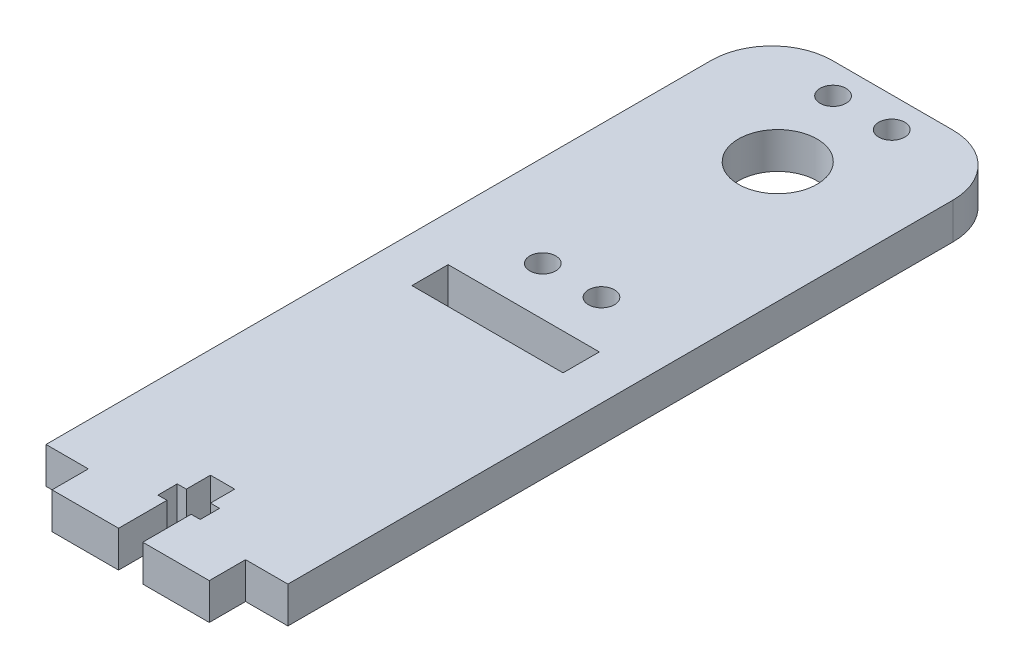
ISO-10303-21;
HEADER;
FILE_DESCRIPTION(('STEP AP214'),'2;1');
FILE_NAME('part.step','',(''),(''),'','','');
FILE_SCHEMA(('AUTOMOTIVE_DESIGN { 1 0 10303 214 1 1 1 1 }'));
ENDSEC;
DATA;
#1=APPLICATION_CONTEXT('core data for automotive mechanical design processes');
#2=APPLICATION_PROTOCOL_DEFINITION('international standard','automotive_design',2000,#1);
#3=PRODUCT_CONTEXT('',#1,'mechanical');
#4=PRODUCT('Part','Part','',(#3));
#5=PRODUCT_RELATED_PRODUCT_CATEGORY('part','',(#4));
#6=PRODUCT_DEFINITION_FORMATION('','',#4);
#7=PRODUCT_DEFINITION_CONTEXT('part definition',#1,'design');
#8=PRODUCT_DEFINITION('design','',#6,#7);
#9=PRODUCT_DEFINITION_SHAPE('','',#8);
#10=(LENGTH_UNIT() NAMED_UNIT(*) SI_UNIT(.MILLI.,.METRE.));
#11=(NAMED_UNIT(*) PLANE_ANGLE_UNIT() SI_UNIT($,.RADIAN.));
#12=(NAMED_UNIT(*) SI_UNIT($,.STERADIAN.) SOLID_ANGLE_UNIT());
#13=UNCERTAINTY_MEASURE_WITH_UNIT(LENGTH_MEASURE(1.E-05),#10,'distance_accuracy_value','');
#14=(GEOMETRIC_REPRESENTATION_CONTEXT(3) GLOBAL_UNCERTAINTY_ASSIGNED_CONTEXT((#13)) GLOBAL_UNIT_ASSIGNED_CONTEXT((#10,
#11,#12)) REPRESENTATION_CONTEXT('',''));
#15=CARTESIAN_POINT('',(0.,0.,0.));
#16=DIRECTION('',(0.,0.,1.));
#17=DIRECTION('',(1.,0.,0.));
#18=AXIS2_PLACEMENT_3D('',#15,#16,#17);
#19=CARTESIAN_POINT('',(13.,-6.,60.));
#20=DIRECTION('',(0.,0.,1.));
#21=DIRECTION('',(1.,0.,0.));
#22=AXIS2_PLACEMENT_3D('',#19,#20,#21);
#23=PLANE('',#22);
#24=DIRECTION('',(1.,0.,0.));
#25=VECTOR('',#24,1.);
#26=CARTESIAN_POINT('',(13.,0.,60.));
#27=LINE('',#26,#25);
#28=CARTESIAN_POINT('',(13.,0.,60.));
#29=VERTEX_POINT('',#28);
#30=CARTESIAN_POINT('',(20.,0.,60.));
#31=VERTEX_POINT('',#30);
#32=EDGE_CURVE('E302',#29,#31,#27,.T.);
#33=ORIENTED_EDGE('',*,*,#32,.F.);
#34=DIRECTION('',(0.,1.,0.));
#35=VECTOR('',#34,1.);
#36=CARTESIAN_POINT('',(13.,-6.,60.));
#37=LINE('',#36,#35);
#38=CARTESIAN_POINT('',(13.,-6.,60.));
#39=VERTEX_POINT('',#38);
#40=EDGE_CURVE('E11',#39,#29,#37,.T.);
#41=ORIENTED_EDGE('',*,*,#40,.F.);
#42=DIRECTION('',(1.,0.,0.));
#43=VECTOR('',#42,1.);
#44=CARTESIAN_POINT('',(13.,-6.,60.));
#45=LINE('',#44,#43);
#46=CARTESIAN_POINT('',(20.,-6.,60.));
#47=VERTEX_POINT('',#46);
#48=EDGE_CURVE('E306',#39,#47,#45,.T.);
#49=ORIENTED_EDGE('',*,*,#48,.T.);
#50=DIRECTION('',(0.,1.,0.));
#51=VECTOR('',#50,1.);
#52=CARTESIAN_POINT('',(20.,-6.,60.));
#53=LINE('',#52,#51);
#54=EDGE_CURVE('E46',#47,#31,#53,.T.);
#55=ORIENTED_EDGE('',*,*,#54,.T.);
#56=EDGE_LOOP('',(#33,#41,#49,#55));
#57=FACE_BOUND('',#56,.T.);
#58=ADVANCED_FACE('F43',(#57),#23,.T.);
#59=CARTESIAN_POINT('',(13.,-6.,66.));
#60=DIRECTION('',(1.,0.,0.));
#61=DIRECTION('',(0.,0.,-1.));
#62=AXIS2_PLACEMENT_3D('',#59,#60,#61);
#63=PLANE('',#62);
#64=DIRECTION('',(0.,0.,-1.));
#65=VECTOR('',#64,1.);
#66=CARTESIAN_POINT('',(13.,0.,66.));
#67=LINE('',#66,#65);
#68=CARTESIAN_POINT('',(13.,0.,66.));
#69=VERTEX_POINT('',#68);
#70=EDGE_CURVE('E311',#69,#29,#67,.T.);
#71=ORIENTED_EDGE('',*,*,#70,.F.);
#72=DIRECTION('',(0.,1.,0.));
#73=VECTOR('',#72,1.);
#74=CARTESIAN_POINT('',(13.,-6.,66.));
#75=LINE('',#74,#73);
#76=CARTESIAN_POINT('',(13.,-6.,66.));
#77=VERTEX_POINT('',#76);
#78=EDGE_CURVE('E52',#77,#69,#75,.T.);
#79=ORIENTED_EDGE('',*,*,#78,.F.);
#80=DIRECTION('',(0.,0.,-1.));
#81=VECTOR('',#80,1.);
#82=CARTESIAN_POINT('',(13.,-6.,66.));
#83=LINE('',#82,#81);
#84=EDGE_CURVE('E391',#77,#39,#83,.T.);
#85=ORIENTED_EDGE('',*,*,#84,.T.);
#86=ORIENTED_EDGE('',*,*,#40,.T.);
#87=EDGE_LOOP('',(#71,#79,#85,#86));
#88=FACE_BOUND('',#87,.T.);
#89=ADVANCED_FACE('F552',(#88),#63,.T.);
#90=CARTESIAN_POINT('',(2.00000000000003,-6.,66.));
#91=DIRECTION('',(0.,0.,1.));
#92=DIRECTION('',(1.,0.,0.));
#93=AXIS2_PLACEMENT_3D('',#90,#91,#92);
#94=PLANE('',#93);
#95=DIRECTION('',(1.,0.,0.));
#96=VECTOR('',#95,1.);
#97=CARTESIAN_POINT('',(2.00000000000003,0.,66.));
#98=LINE('',#97,#96);
#99=CARTESIAN_POINT('',(2.00000000000003,0.,66.));
#100=VERTEX_POINT('',#99);
#101=EDGE_CURVE('E474',#100,#69,#98,.T.);
#102=ORIENTED_EDGE('',*,*,#101,.F.);
#103=DIRECTION('',(0.,1.,0.));
#104=VECTOR('',#103,1.);
#105=CARTESIAN_POINT('',(2.00000000000003,-6.,66.));
#106=LINE('',#105,#104);
#107=CARTESIAN_POINT('',(2.00000000000003,-6.,66.));
#108=VERTEX_POINT('',#107);
#109=EDGE_CURVE('E483',#108,#100,#106,.T.);
#110=ORIENTED_EDGE('',*,*,#109,.F.);
#111=DIRECTION('',(1.,0.,0.));
#112=VECTOR('',#111,1.);
#113=CARTESIAN_POINT('',(2.00000000000003,-6.,66.));
#114=LINE('',#113,#112);
#115=EDGE_CURVE('E387',#108,#77,#114,.T.);
#116=ORIENTED_EDGE('',*,*,#115,.T.);
#117=ORIENTED_EDGE('',*,*,#78,.T.);
#118=EDGE_LOOP('',(#102,#110,#116,#117));
#119=FACE_BOUND('',#118,.T.);
#120=ADVANCED_FACE('F628',(#119),#94,.T.);
#121=CARTESIAN_POINT('',(2.00000000000003,-6.,58.));
#122=DIRECTION('',(-1.,0.,0.));
#123=DIRECTION('',(0.,0.,1.));
#124=AXIS2_PLACEMENT_3D('',#121,#122,#123);
#125=PLANE('',#124);
#126=DIRECTION('',(0.,0.,1.));
#127=VECTOR('',#126,1.);
#128=CARTESIAN_POINT('',(2.00000000000003,0.,58.));
#129=LINE('',#128,#127);
#130=CARTESIAN_POINT('',(2.00000000000003,0.,58.));
#131=VERTEX_POINT('',#130);
#132=EDGE_CURVE('E470',#131,#100,#129,.T.);
#133=ORIENTED_EDGE('',*,*,#132,.F.);
#134=DIRECTION('',(0.,1.,0.));
#135=VECTOR('',#134,1.);
#136=CARTESIAN_POINT('',(2.00000000000003,-6.,58.));
#137=LINE('',#136,#135);
#138=CARTESIAN_POINT('',(2.00000000000003,-6.,58.));
#139=VERTEX_POINT('',#138);
#140=EDGE_CURVE('E486',#139,#131,#137,.T.);
#141=ORIENTED_EDGE('',*,*,#140,.F.);
#142=DIRECTION('',(0.,0.,1.));
#143=VECTOR('',#142,1.);
#144=CARTESIAN_POINT('',(2.00000000000003,-6.,58.));
#145=LINE('',#144,#143);
#146=EDGE_CURVE('E383',#139,#108,#145,.T.);
#147=ORIENTED_EDGE('',*,*,#146,.T.);
#148=ORIENTED_EDGE('',*,*,#109,.T.);
#149=EDGE_LOOP('',(#133,#141,#147,#148));
#150=FACE_BOUND('',#149,.T.);
#151=ADVANCED_FACE('F626',(#150),#125,.T.);
#152=CARTESIAN_POINT('',(3.50000000000003,-6.,58.));
#153=DIRECTION('',(0.,0.,-1.));
#154=DIRECTION('',(-1.,0.,0.));
#155=AXIS2_PLACEMENT_3D('',#152,#153,#154);
#156=PLANE('',#155);
#157=DIRECTION('',(-1.,0.,0.));
#158=VECTOR('',#157,1.);
#159=CARTESIAN_POINT('',(3.50000000000003,0.,58.));
#160=LINE('',#159,#158);
#161=CARTESIAN_POINT('',(3.50000000000003,0.,58.));
#162=VERTEX_POINT('',#161);
#163=EDGE_CURVE('E466',#162,#131,#160,.T.);
#164=ORIENTED_EDGE('',*,*,#163,.F.);
#165=DIRECTION('',(0.,1.,0.));
#166=VECTOR('',#165,1.);
#167=CARTESIAN_POINT('',(3.50000000000003,-6.,58.));
#168=LINE('',#167,#166);
#169=CARTESIAN_POINT('',(3.50000000000003,-6.,58.));
#170=VERTEX_POINT('',#169);
#171=EDGE_CURVE('E489',#170,#162,#168,.T.);
#172=ORIENTED_EDGE('',*,*,#171,.F.);
#173=DIRECTION('',(-1.,0.,0.));
#174=VECTOR('',#173,1.);
#175=CARTESIAN_POINT('',(3.50000000000003,-6.,58.));
#176=LINE('',#175,#174);
#177=EDGE_CURVE('E379',#170,#139,#176,.T.);
#178=ORIENTED_EDGE('',*,*,#177,.T.);
#179=ORIENTED_EDGE('',*,*,#140,.T.);
#180=EDGE_LOOP('',(#164,#172,#178,#179));
#181=FACE_BOUND('',#180,.T.);
#182=ADVANCED_FACE('F622',(#181),#156,.T.);
#183=CARTESIAN_POINT('',(3.50000000000003,-6.,54.8));
#184=DIRECTION('',(-1.,0.,0.));
#185=DIRECTION('',(0.,0.,1.));
#186=AXIS2_PLACEMENT_3D('',#183,#184,#185);
#187=PLANE('',#186);
#188=DIRECTION('',(0.,0.,1.));
#189=VECTOR('',#188,1.);
#190=CARTESIAN_POINT('',(3.50000000000003,0.,54.8));
#191=LINE('',#190,#189);
#192=CARTESIAN_POINT('',(3.50000000000003,0.,54.8));
#193=VERTEX_POINT('',#192);
#194=EDGE_CURVE('E462',#193,#162,#191,.T.);
#195=ORIENTED_EDGE('',*,*,#194,.F.);
#196=DIRECTION('',(0.,1.,0.));
#197=VECTOR('',#196,1.);
#198=CARTESIAN_POINT('',(3.50000000000003,-6.,54.8));
#199=LINE('',#198,#197);
#200=CARTESIAN_POINT('',(3.50000000000003,-6.,54.8));
#201=VERTEX_POINT('',#200);
#202=EDGE_CURVE('E492',#201,#193,#199,.T.);
#203=ORIENTED_EDGE('',*,*,#202,.F.);
#204=DIRECTION('',(0.,0.,1.));
#205=VECTOR('',#204,1.);
#206=CARTESIAN_POINT('',(3.50000000000003,-6.,54.8));
#207=LINE('',#206,#205);
#208=EDGE_CURVE('E375',#201,#170,#207,.T.);
#209=ORIENTED_EDGE('',*,*,#208,.T.);
#210=ORIENTED_EDGE('',*,*,#171,.T.);
#211=EDGE_LOOP('',(#195,#203,#209,#210));
#212=FACE_BOUND('',#211,.T.);
#213=ADVANCED_FACE('F618',(#212),#187,.T.);
#214=CARTESIAN_POINT('',(2.00000000000003,-6.,54.8));
#215=DIRECTION('',(0.,0.,1.));
#216=DIRECTION('',(1.,0.,0.));
#217=AXIS2_PLACEMENT_3D('',#214,#215,#216);
#218=PLANE('',#217);
#219=DIRECTION('',(1.,0.,0.));
#220=VECTOR('',#219,1.);
#221=CARTESIAN_POINT('',(2.00000000000003,0.,54.8));
#222=LINE('',#221,#220);
#223=CARTESIAN_POINT('',(2.00000000000003,0.,54.8));
#224=VERTEX_POINT('',#223);
#225=EDGE_CURVE('E458',#224,#193,#222,.T.);
#226=ORIENTED_EDGE('',*,*,#225,.F.);
#227=DIRECTION('',(0.,1.,0.));
#228=VECTOR('',#227,1.);
#229=CARTESIAN_POINT('',(2.00000000000003,-6.,54.8));
#230=LINE('',#229,#228);
#231=CARTESIAN_POINT('',(2.00000000000003,-6.,54.8));
#232=VERTEX_POINT('',#231);
#233=EDGE_CURVE('E495',#232,#224,#230,.T.);
#234=ORIENTED_EDGE('',*,*,#233,.F.);
#235=DIRECTION('',(1.,0.,0.));
#236=VECTOR('',#235,1.);
#237=CARTESIAN_POINT('',(2.00000000000003,-6.,54.8));
#238=LINE('',#237,#236);
#239=EDGE_CURVE('E371',#232,#201,#238,.T.);
#240=ORIENTED_EDGE('',*,*,#239,.T.);
#241=ORIENTED_EDGE('',*,*,#202,.T.);
#242=EDGE_LOOP('',(#226,#234,#240,#241));
#243=FACE_BOUND('',#242,.T.);
#244=ADVANCED_FACE('F614',(#243),#218,.T.);
#245=CARTESIAN_POINT('',(2.00000000000003,-6.,50.8));
#246=DIRECTION('',(-1.,0.,0.));
#247=DIRECTION('',(0.,0.,1.));
#248=AXIS2_PLACEMENT_3D('',#245,#246,#247);
#249=PLANE('',#248);
#250=DIRECTION('',(0.,0.,1.));
#251=VECTOR('',#250,1.);
#252=CARTESIAN_POINT('',(2.00000000000003,0.,50.8));
#253=LINE('',#252,#251);
#254=CARTESIAN_POINT('',(2.00000000000003,0.,50.8));
#255=VERTEX_POINT('',#254);
#256=EDGE_CURVE('E454',#255,#224,#253,.T.);
#257=ORIENTED_EDGE('',*,*,#256,.F.);
#258=DIRECTION('',(0.,1.,0.));
#259=VECTOR('',#258,1.);
#260=CARTESIAN_POINT('',(2.00000000000003,-6.,50.8));
#261=LINE('',#260,#259);
#262=CARTESIAN_POINT('',(2.00000000000003,-6.,50.8));
#263=VERTEX_POINT('',#262);
#264=EDGE_CURVE('E498',#263,#255,#261,.T.);
#265=ORIENTED_EDGE('',*,*,#264,.F.);
#266=DIRECTION('',(0.,0.,1.));
#267=VECTOR('',#266,1.);
#268=CARTESIAN_POINT('',(2.00000000000003,-6.,50.8));
#269=LINE('',#268,#267);
#270=EDGE_CURVE('E367',#263,#232,#269,.T.);
#271=ORIENTED_EDGE('',*,*,#270,.T.);
#272=ORIENTED_EDGE('',*,*,#233,.T.);
#273=EDGE_LOOP('',(#257,#265,#271,#272));
#274=FACE_BOUND('',#273,.T.);
#275=ADVANCED_FACE('F610',(#274),#249,.T.);
#276=CARTESIAN_POINT('',(-1.99999999999997,-6.,50.8));
#277=DIRECTION('',(0.,0.,1.));
#278=DIRECTION('',(1.,0.,0.));
#279=AXIS2_PLACEMENT_3D('',#276,#277,#278);
#280=PLANE('',#279);
#281=DIRECTION('',(1.,0.,0.));
#282=VECTOR('',#281,1.);
#283=CARTESIAN_POINT('',(-1.99999999999997,0.,50.8));
#284=LINE('',#283,#282);
#285=CARTESIAN_POINT('',(-1.99999999999997,0.,50.8));
#286=VERTEX_POINT('',#285);
#287=EDGE_CURVE('E450',#286,#255,#284,.T.);
#288=ORIENTED_EDGE('',*,*,#287,.F.);
#289=DIRECTION('',(0.,1.,0.));
#290=VECTOR('',#289,1.);
#291=CARTESIAN_POINT('',(-1.99999999999997,-6.,50.8));
#292=LINE('',#291,#290);
#293=CARTESIAN_POINT('',(-1.99999999999997,-6.,50.8));
#294=VERTEX_POINT('',#293);
#295=EDGE_CURVE('E501',#294,#286,#292,.T.);
#296=ORIENTED_EDGE('',*,*,#295,.F.);
#297=DIRECTION('',(1.,0.,0.));
#298=VECTOR('',#297,1.);
#299=CARTESIAN_POINT('',(-1.99999999999997,-6.,50.8));
#300=LINE('',#299,#298);
#301=EDGE_CURVE('E363',#294,#263,#300,.T.);
#302=ORIENTED_EDGE('',*,*,#301,.T.);
#303=ORIENTED_EDGE('',*,*,#264,.T.);
#304=EDGE_LOOP('',(#288,#296,#302,#303));
#305=FACE_BOUND('',#304,.T.);
#306=ADVANCED_FACE('F606',(#305),#280,.T.);
#307=CARTESIAN_POINT('',(-1.99999999999997,-6.,54.8));
#308=DIRECTION('',(1.,0.,0.));
#309=DIRECTION('',(0.,0.,-1.));
#310=AXIS2_PLACEMENT_3D('',#307,#308,#309);
#311=PLANE('',#310);
#312=DIRECTION('',(0.,0.,-1.));
#313=VECTOR('',#312,1.);
#314=CARTESIAN_POINT('',(-1.99999999999997,0.,54.8));
#315=LINE('',#314,#313);
#316=CARTESIAN_POINT('',(-1.99999999999997,0.,54.8));
#317=VERTEX_POINT('',#316);
#318=EDGE_CURVE('E446',#317,#286,#315,.T.);
#319=ORIENTED_EDGE('',*,*,#318,.F.);
#320=DIRECTION('',(0.,1.,0.));
#321=VECTOR('',#320,1.);
#322=CARTESIAN_POINT('',(-1.99999999999997,-6.,54.8));
#323=LINE('',#322,#321);
#324=CARTESIAN_POINT('',(-1.99999999999997,-6.,54.8));
#325=VERTEX_POINT('',#324);
#326=EDGE_CURVE('E504',#325,#317,#323,.T.);
#327=ORIENTED_EDGE('',*,*,#326,.F.);
#328=DIRECTION('',(0.,0.,-1.));
#329=VECTOR('',#328,1.);
#330=CARTESIAN_POINT('',(-1.99999999999997,-6.,54.8));
#331=LINE('',#330,#329);
#332=EDGE_CURVE('E359',#325,#294,#331,.T.);
#333=ORIENTED_EDGE('',*,*,#332,.T.);
#334=ORIENTED_EDGE('',*,*,#295,.T.);
#335=EDGE_LOOP('',(#319,#327,#333,#334));
#336=FACE_BOUND('',#335,.T.);
#337=ADVANCED_FACE('F602',(#336),#311,.T.);
#338=CARTESIAN_POINT('',(-3.49999999999997,-6.,54.8));
#339=DIRECTION('',(0.,0.,1.));
#340=DIRECTION('',(1.,0.,0.));
#341=AXIS2_PLACEMENT_3D('',#338,#339,#340);
#342=PLANE('',#341);
#343=DIRECTION('',(1.,0.,0.));
#344=VECTOR('',#343,1.);
#345=CARTESIAN_POINT('',(-3.49999999999997,0.,54.8));
#346=LINE('',#345,#344);
#347=CARTESIAN_POINT('',(-3.49999999999997,0.,54.8));
#348=VERTEX_POINT('',#347);
#349=EDGE_CURVE('E442',#348,#317,#346,.T.);
#350=ORIENTED_EDGE('',*,*,#349,.F.);
#351=DIRECTION('',(0.,1.,0.));
#352=VECTOR('',#351,1.);
#353=CARTESIAN_POINT('',(-3.49999999999997,-6.,54.8));
#354=LINE('',#353,#352);
#355=CARTESIAN_POINT('',(-3.49999999999997,-6.,54.8));
#356=VERTEX_POINT('',#355);
#357=EDGE_CURVE('E507',#356,#348,#354,.T.);
#358=ORIENTED_EDGE('',*,*,#357,.F.);
#359=DIRECTION('',(1.,0.,0.));
#360=VECTOR('',#359,1.);
#361=CARTESIAN_POINT('',(-3.49999999999997,-6.,54.8));
#362=LINE('',#361,#360);
#363=EDGE_CURVE('E355',#356,#325,#362,.T.);
#364=ORIENTED_EDGE('',*,*,#363,.T.);
#365=ORIENTED_EDGE('',*,*,#326,.T.);
#366=EDGE_LOOP('',(#350,#358,#364,#365));
#367=FACE_BOUND('',#366,.T.);
#368=ADVANCED_FACE('F598',(#367),#342,.T.);
#369=CARTESIAN_POINT('',(-3.49999999999997,-6.,58.));
#370=DIRECTION('',(1.,0.,0.));
#371=DIRECTION('',(0.,0.,-1.));
#372=AXIS2_PLACEMENT_3D('',#369,#370,#371);
#373=PLANE('',#372);
#374=DIRECTION('',(0.,0.,-1.));
#375=VECTOR('',#374,1.);
#376=CARTESIAN_POINT('',(-3.49999999999997,0.,58.));
#377=LINE('',#376,#375);
#378=CARTESIAN_POINT('',(-3.49999999999997,0.,58.));
#379=VERTEX_POINT('',#378);
#380=EDGE_CURVE('E438',#379,#348,#377,.T.);
#381=ORIENTED_EDGE('',*,*,#380,.F.);
#382=DIRECTION('',(0.,1.,0.));
#383=VECTOR('',#382,1.);
#384=CARTESIAN_POINT('',(-3.49999999999997,-6.,58.));
#385=LINE('',#384,#383);
#386=CARTESIAN_POINT('',(-3.49999999999997,-6.,58.));
#387=VERTEX_POINT('',#386);
#388=EDGE_CURVE('E510',#387,#379,#385,.T.);
#389=ORIENTED_EDGE('',*,*,#388,.F.);
#390=DIRECTION('',(0.,0.,-1.));
#391=VECTOR('',#390,1.);
#392=CARTESIAN_POINT('',(-3.49999999999997,-6.,58.));
#393=LINE('',#392,#391);
#394=EDGE_CURVE('E351',#387,#356,#393,.T.);
#395=ORIENTED_EDGE('',*,*,#394,.T.);
#396=ORIENTED_EDGE('',*,*,#357,.T.);
#397=EDGE_LOOP('',(#381,#389,#395,#396));
#398=FACE_BOUND('',#397,.T.);
#399=ADVANCED_FACE('F594',(#398),#373,.T.);
#400=CARTESIAN_POINT('',(-1.99999999999997,-6.,58.));
#401=DIRECTION('',(0.,0.,-1.));
#402=DIRECTION('',(-1.,0.,0.));
#403=AXIS2_PLACEMENT_3D('',#400,#401,#402);
#404=PLANE('',#403);
#405=DIRECTION('',(-1.,0.,0.));
#406=VECTOR('',#405,1.);
#407=CARTESIAN_POINT('',(-1.99999999999997,0.,58.));
#408=LINE('',#407,#406);
#409=CARTESIAN_POINT('',(-1.99999999999997,0.,58.));
#410=VERTEX_POINT('',#409);
#411=EDGE_CURVE('E434',#410,#379,#408,.T.);
#412=ORIENTED_EDGE('',*,*,#411,.F.);
#413=DIRECTION('',(0.,1.,0.));
#414=VECTOR('',#413,1.);
#415=CARTESIAN_POINT('',(-1.99999999999997,-6.,58.));
#416=LINE('',#415,#414);
#417=CARTESIAN_POINT('',(-1.99999999999997,-6.,58.));
#418=VERTEX_POINT('',#417);
#419=EDGE_CURVE('E513',#418,#410,#416,.T.);
#420=ORIENTED_EDGE('',*,*,#419,.F.);
#421=DIRECTION('',(-1.,0.,0.));
#422=VECTOR('',#421,1.);
#423=CARTESIAN_POINT('',(-1.99999999999997,-6.,58.));
#424=LINE('',#423,#422);
#425=EDGE_CURVE('E347',#418,#387,#424,.T.);
#426=ORIENTED_EDGE('',*,*,#425,.T.);
#427=ORIENTED_EDGE('',*,*,#388,.T.);
#428=EDGE_LOOP('',(#412,#420,#426,#427));
#429=FACE_BOUND('',#428,.T.);
#430=ADVANCED_FACE('F590',(#429),#404,.T.);
#431=CARTESIAN_POINT('',(-1.99999999999997,-6.,66.));
#432=DIRECTION('',(1.,0.,0.));
#433=DIRECTION('',(0.,0.,-1.));
#434=AXIS2_PLACEMENT_3D('',#431,#432,#433);
#435=PLANE('',#434);
#436=DIRECTION('',(0.,0.,-1.));
#437=VECTOR('',#436,1.);
#438=CARTESIAN_POINT('',(-1.99999999999997,0.,66.));
#439=LINE('',#438,#437);
#440=CARTESIAN_POINT('',(-1.99999999999997,0.,66.));
#441=VERTEX_POINT('',#440);
#442=EDGE_CURVE('E430',#441,#410,#439,.T.);
#443=ORIENTED_EDGE('',*,*,#442,.F.);
#444=DIRECTION('',(0.,1.,0.));
#445=VECTOR('',#444,1.);
#446=CARTESIAN_POINT('',(-1.99999999999997,-6.,66.));
#447=LINE('',#446,#445);
#448=CARTESIAN_POINT('',(-1.99999999999997,-6.,66.));
#449=VERTEX_POINT('',#448);
#450=EDGE_CURVE('E516',#449,#441,#447,.T.);
#451=ORIENTED_EDGE('',*,*,#450,.F.);
#452=DIRECTION('',(0.,0.,-1.));
#453=VECTOR('',#452,1.);
#454=CARTESIAN_POINT('',(-1.99999999999997,-6.,66.));
#455=LINE('',#454,#453);
#456=EDGE_CURVE('E343',#449,#418,#455,.T.);
#457=ORIENTED_EDGE('',*,*,#456,.T.);
#458=ORIENTED_EDGE('',*,*,#419,.T.);
#459=EDGE_LOOP('',(#443,#451,#457,#458));
#460=FACE_BOUND('',#459,.T.);
#461=ADVANCED_FACE('F586',(#460),#435,.T.);
#462=CARTESIAN_POINT('',(-13.,-6.,66.));
#463=DIRECTION('',(0.,0.,1.));
#464=DIRECTION('',(1.,0.,0.));
#465=AXIS2_PLACEMENT_3D('',#462,#463,#464);
#466=PLANE('',#465);
#467=DIRECTION('',(1.,0.,0.));
#468=VECTOR('',#467,1.);
#469=CARTESIAN_POINT('',(-13.,0.,66.));
#470=LINE('',#469,#468);
#471=CARTESIAN_POINT('',(-13.,0.,66.));
#472=VERTEX_POINT('',#471);
#473=EDGE_CURVE('E426',#472,#441,#470,.T.);
#474=ORIENTED_EDGE('',*,*,#473,.F.);
#475=DIRECTION('',(0.,1.,0.));
#476=VECTOR('',#475,1.);
#477=CARTESIAN_POINT('',(-13.,-6.,66.));
#478=LINE('',#477,#476);
#479=CARTESIAN_POINT('',(-13.,-6.,66.));
#480=VERTEX_POINT('',#479);
#481=EDGE_CURVE('E519',#480,#472,#478,.T.);
#482=ORIENTED_EDGE('',*,*,#481,.F.);
#483=DIRECTION('',(1.,0.,0.));
#484=VECTOR('',#483,1.);
#485=CARTESIAN_POINT('',(-13.,-6.,66.));
#486=LINE('',#485,#484);
#487=EDGE_CURVE('E339',#480,#449,#486,.T.);
#488=ORIENTED_EDGE('',*,*,#487,.T.);
#489=ORIENTED_EDGE('',*,*,#450,.T.);
#490=EDGE_LOOP('',(#474,#482,#488,#489));
#491=FACE_BOUND('',#490,.T.);
#492=ADVANCED_FACE('F582',(#491),#466,.T.);
#493=CARTESIAN_POINT('',(-13.,-6.,60.));
#494=DIRECTION('',(-1.,0.,0.));
#495=DIRECTION('',(0.,0.,1.));
#496=AXIS2_PLACEMENT_3D('',#493,#494,#495);
#497=PLANE('',#496);
#498=DIRECTION('',(0.,0.,1.));
#499=VECTOR('',#498,1.);
#500=CARTESIAN_POINT('',(-13.,0.,60.));
#501=LINE('',#500,#499);
#502=CARTESIAN_POINT('',(-13.,0.,60.));
#503=VERTEX_POINT('',#502);
#504=EDGE_CURVE('E422',#503,#472,#501,.T.);
#505=ORIENTED_EDGE('',*,*,#504,.F.);
#506=DIRECTION('',(0.,1.,0.));
#507=VECTOR('',#506,1.);
#508=CARTESIAN_POINT('',(-13.,-6.,60.));
#509=LINE('',#508,#507);
#510=CARTESIAN_POINT('',(-13.,-6.,60.));
#511=VERTEX_POINT('',#510);
#512=EDGE_CURVE('E522',#511,#503,#509,.T.);
#513=ORIENTED_EDGE('',*,*,#512,.F.);
#514=DIRECTION('',(0.,0.,1.));
#515=VECTOR('',#514,1.);
#516=CARTESIAN_POINT('',(-13.,-6.,60.));
#517=LINE('',#516,#515);
#518=EDGE_CURVE('E335',#511,#480,#517,.T.);
#519=ORIENTED_EDGE('',*,*,#518,.T.);
#520=ORIENTED_EDGE('',*,*,#481,.T.);
#521=EDGE_LOOP('',(#505,#513,#519,#520));
#522=FACE_BOUND('',#521,.T.);
#523=ADVANCED_FACE('F578',(#522),#497,.T.);
#524=CARTESIAN_POINT('',(-20.,-6.,60.));
#525=DIRECTION('',(0.,0.,1.));
#526=DIRECTION('',(1.,0.,0.));
#527=AXIS2_PLACEMENT_3D('',#524,#525,#526);
#528=PLANE('',#527);
#529=DIRECTION('',(1.,0.,0.));
#530=VECTOR('',#529,1.);
#531=CARTESIAN_POINT('',(-20.,0.,60.));
#532=LINE('',#531,#530);
#533=CARTESIAN_POINT('',(-20.,0.,60.));
#534=VERTEX_POINT('',#533);
#535=EDGE_CURVE('E418',#534,#503,#532,.T.);
#536=ORIENTED_EDGE('',*,*,#535,.F.);
#537=DIRECTION('',(0.,1.,0.));
#538=VECTOR('',#537,1.);
#539=CARTESIAN_POINT('',(-20.,-6.,60.));
#540=LINE('',#539,#538);
#541=CARTESIAN_POINT('',(-20.,-6.,60.));
#542=VERTEX_POINT('',#541);
#543=EDGE_CURVE('E525',#542,#534,#540,.T.);
#544=ORIENTED_EDGE('',*,*,#543,.F.);
#545=DIRECTION('',(1.,0.,0.));
#546=VECTOR('',#545,1.);
#547=CARTESIAN_POINT('',(-20.,-6.,60.));
#548=LINE('',#547,#546);
#549=EDGE_CURVE('E331',#542,#511,#548,.T.);
#550=ORIENTED_EDGE('',*,*,#549,.T.);
#551=ORIENTED_EDGE('',*,*,#512,.T.);
#552=EDGE_LOOP('',(#536,#544,#550,#551));
#553=FACE_BOUND('',#552,.T.);
#554=ADVANCED_FACE('F574',(#553),#528,.T.);
#555=CARTESIAN_POINT('',(-20.,-6.,-50.));
#556=DIRECTION('',(-1.,0.,0.));
#557=DIRECTION('',(0.,0.,1.));
#558=AXIS2_PLACEMENT_3D('',#555,#556,#557);
#559=PLANE('',#558);
#560=DIRECTION('',(0.,0.,1.));
#561=VECTOR('',#560,1.);
#562=CARTESIAN_POINT('',(-20.,0.,-50.));
#563=LINE('',#562,#561);
#564=CARTESIAN_POINT('',(-20.,0.,-50.));
#565=VERTEX_POINT('',#564);
#566=EDGE_CURVE('E414',#565,#534,#563,.T.);
#567=ORIENTED_EDGE('',*,*,#566,.F.);
#568=DIRECTION('',(0.,1.,0.));
#569=VECTOR('',#568,1.);
#570=CARTESIAN_POINT('',(-20.,-6.,-50.));
#571=LINE('',#570,#569);
#572=CARTESIAN_POINT('',(-20.,-6.,-50.));
#573=VERTEX_POINT('',#572);
#574=EDGE_CURVE('E528',#573,#565,#571,.T.);
#575=ORIENTED_EDGE('',*,*,#574,.F.);
#576=DIRECTION('',(0.,0.,1.));
#577=VECTOR('',#576,1.);
#578=CARTESIAN_POINT('',(-20.,-6.,-50.));
#579=LINE('',#578,#577);
#580=EDGE_CURVE('E327',#573,#542,#579,.T.);
#581=ORIENTED_EDGE('',*,*,#580,.T.);
#582=ORIENTED_EDGE('',*,*,#543,.T.);
#583=EDGE_LOOP('',(#567,#575,#581,#582));
#584=FACE_BOUND('',#583,.T.);
#585=ADVANCED_FACE('F570',(#584),#559,.T.);
#586=CARTESIAN_POINT('',(-9.99999999999999,-6.,-50.));
#587=DIRECTION('',(0.,1.,0.));
#588=DIRECTION('',(0.,0.,1.));
#589=AXIS2_PLACEMENT_3D('',#586,#587,#588);
#590=CYLINDRICAL_SURFACE('',#589,10.);
#591=CARTESIAN_POINT('',(-9.99999999999999,0.,-50.));
#592=DIRECTION('',(0.,1.,0.));
#593=DIRECTION('',(0.,0.,1.));
#594=AXIS2_PLACEMENT_3D('',#591,#592,#593);
#595=CIRCLE('',#594,10.);
#596=CARTESIAN_POINT('',(-9.99999999999999,0.,-60.));
#597=VERTEX_POINT('',#596);
#598=EDGE_CURVE('E410',#597,#565,#595,.T.);
#599=ORIENTED_EDGE('',*,*,#598,.F.);
#600=DIRECTION('',(0.,1.,0.));
#601=VECTOR('',#600,1.);
#602=CARTESIAN_POINT('',(-9.99999999999999,-6.,-60.));
#603=LINE('',#602,#601);
#604=CARTESIAN_POINT('',(-9.99999999999999,-6.,-60.));
#605=VERTEX_POINT('',#604);
#606=EDGE_CURVE('E531',#605,#597,#603,.T.);
#607=ORIENTED_EDGE('',*,*,#606,.F.);
#608=CARTESIAN_POINT('',(-9.99999999999999,-6.,-50.));
#609=DIRECTION('',(0.,1.,0.));
#610=DIRECTION('',(0.,0.,1.));
#611=AXIS2_PLACEMENT_3D('',#608,#609,#610);
#612=CIRCLE('',#611,10.);
#613=EDGE_CURVE('E323',#605,#573,#612,.T.);
#614=ORIENTED_EDGE('',*,*,#613,.T.);
#615=ORIENTED_EDGE('',*,*,#574,.T.);
#616=EDGE_LOOP('',(#599,#607,#614,#615));
#617=FACE_BOUND('',#616,.T.);
#618=ADVANCED_FACE('F566',(#617),#590,.T.);
#619=CARTESIAN_POINT('',(-9.99999999999999,-6.,-60.));
#620=DIRECTION('',(0.,0.,-1.));
#621=DIRECTION('',(-1.,0.,0.));
#622=AXIS2_PLACEMENT_3D('',#619,#620,#621);
#623=PLANE('',#622);
#624=DIRECTION('',(-1.,0.,0.));
#625=VECTOR('',#624,1.);
#626=CARTESIAN_POINT('',(-9.99999999999999,0.,-60.));
#627=LINE('',#626,#625);
#628=CARTESIAN_POINT('',(10.,0.,-60.));
#629=VERTEX_POINT('',#628);
#630=EDGE_CURVE('E406',#629,#597,#627,.T.);
#631=ORIENTED_EDGE('',*,*,#630,.F.);
#632=DIRECTION('',(0.,1.,0.));
#633=VECTOR('',#632,1.);
#634=CARTESIAN_POINT('',(10.,-6.,-60.));
#635=LINE('',#634,#633);
#636=CARTESIAN_POINT('',(10.,-6.,-60.));
#637=VERTEX_POINT('',#636);
#638=EDGE_CURVE('E534',#637,#629,#635,.T.);
#639=ORIENTED_EDGE('',*,*,#638,.F.);
#640=DIRECTION('',(-1.,0.,0.));
#641=VECTOR('',#640,1.);
#642=CARTESIAN_POINT('',(-9.99999999999999,-6.,-60.));
#643=LINE('',#642,#641);
#644=EDGE_CURVE('E319',#637,#605,#643,.T.);
#645=ORIENTED_EDGE('',*,*,#644,.T.);
#646=ORIENTED_EDGE('',*,*,#606,.T.);
#647=EDGE_LOOP('',(#631,#639,#645,#646));
#648=FACE_BOUND('',#647,.T.);
#649=ADVANCED_FACE('F564',(#648),#623,.T.);
#650=CARTESIAN_POINT('',(10.,-6.,-50.));
#651=DIRECTION('',(0.,1.,0.));
#652=DIRECTION('',(0.,0.,1.));
#653=AXIS2_PLACEMENT_3D('',#650,#651,#652);
#654=CYLINDRICAL_SURFACE('',#653,10.);
#655=CARTESIAN_POINT('',(10.,0.,-50.));
#656=DIRECTION('',(0.,1.,0.));
#657=DIRECTION('',(0.,0.,-1.));
#658=AXIS2_PLACEMENT_3D('',#655,#656,#657);
#659=CIRCLE('',#658,10.);
#660=CARTESIAN_POINT('',(20.,0.,-50.));
#661=VERTEX_POINT('',#660);
#662=EDGE_CURVE('E402',#661,#629,#659,.T.);
#663=ORIENTED_EDGE('',*,*,#662,.F.);
#664=DIRECTION('',(0.,1.,0.));
#665=VECTOR('',#664,1.);
#666=CARTESIAN_POINT('',(20.,-6.,-50.));
#667=LINE('',#666,#665);
#668=CARTESIAN_POINT('',(20.,-6.,-50.));
#669=VERTEX_POINT('',#668);
#670=EDGE_CURVE('E536',#669,#661,#667,.T.);
#671=ORIENTED_EDGE('',*,*,#670,.F.);
#672=CARTESIAN_POINT('',(10.,-6.,-50.));
#673=DIRECTION('',(0.,1.,0.));
#674=DIRECTION('',(0.,0.,-1.));
#675=AXIS2_PLACEMENT_3D('',#672,#673,#674);
#676=CIRCLE('',#675,10.);
#677=EDGE_CURVE('E315',#669,#637,#676,.T.);
#678=ORIENTED_EDGE('',*,*,#677,.T.);
#679=ORIENTED_EDGE('',*,*,#638,.T.);
#680=EDGE_LOOP('',(#663,#671,#678,#679));
#681=FACE_BOUND('',#680,.T.);
#682=ADVANCED_FACE('F560',(#681),#654,.T.);
#683=CARTESIAN_POINT('',(20.,-6.,-50.));
#684=DIRECTION('',(1.,0.,0.));
#685=DIRECTION('',(0.,0.,-1.));
#686=AXIS2_PLACEMENT_3D('',#683,#684,#685);
#687=PLANE('',#686);
#688=DIRECTION('',(0.,0.,-1.));
#689=VECTOR('',#688,1.);
#690=CARTESIAN_POINT('',(20.,0.,-50.));
#691=LINE('',#690,#689);
#692=EDGE_CURVE('E398',#31,#661,#691,.T.);
#693=ORIENTED_EDGE('',*,*,#692,.F.);
#694=ORIENTED_EDGE('',*,*,#54,.F.);
#695=DIRECTION('',(0.,0.,-1.));
#696=VECTOR('',#695,1.);
#697=CARTESIAN_POINT('',(20.,-6.,-50.));
#698=LINE('',#697,#696);
#699=EDGE_CURVE('E310',#47,#669,#698,.T.);
#700=ORIENTED_EDGE('',*,*,#699,.T.);
#701=ORIENTED_EDGE('',*,*,#670,.T.);
#702=EDGE_LOOP('',(#693,#694,#700,#701));
#703=FACE_BOUND('',#702,.T.);
#704=ADVANCED_FACE('F546',(#703),#687,.T.);
#705=CARTESIAN_POINT('',(10.,-6.,-50.));
#706=DIRECTION('',(0.,-1.,0.));
#707=DIRECTION('',(0.,0.,-1.));
#708=AXIS2_PLACEMENT_3D('',#705,#706,#707);
#709=PLANE('',#708);
#710=DIRECTION('',(0.,0.,-1.));
#711=VECTOR('',#710,1.);
#712=CARTESIAN_POINT('',(12.5,-6.,0.999999999999968));
#713=LINE('',#712,#711);
#714=CARTESIAN_POINT('',(12.5,-6.,6.99999999999997));
#715=VERTEX_POINT('',#714);
#716=CARTESIAN_POINT('',(12.5,-6.,0.999999999999968));
#717=VERTEX_POINT('',#716);
#718=EDGE_CURVE('E219',#715,#717,#713,.T.);
#719=ORIENTED_EDGE('',*,*,#718,.T.);
#720=DIRECTION('',(-1.,0.,0.));
#721=VECTOR('',#720,1.);
#722=CARTESIAN_POINT('',(-12.5,-6.,0.999999999999968));
#723=LINE('',#722,#721);
#724=CARTESIAN_POINT('',(-12.5,-6.,0.999999999999966));
#725=VERTEX_POINT('',#724);
#726=EDGE_CURVE('E229',#717,#725,#723,.T.);
#727=ORIENTED_EDGE('',*,*,#726,.T.);
#728=DIRECTION('',(0.,0.,1.));
#729=VECTOR('',#728,1.);
#730=CARTESIAN_POINT('',(-12.5,-6.,0.999999999999968));
#731=LINE('',#730,#729);
#732=CARTESIAN_POINT('',(-12.5,-6.,6.99999999999997));
#733=VERTEX_POINT('',#732);
#734=EDGE_CURVE('E60',#725,#733,#731,.T.);
#735=ORIENTED_EDGE('',*,*,#734,.T.);
#736=DIRECTION('',(1.,0.,0.));
#737=VECTOR('',#736,1.);
#738=CARTESIAN_POINT('',(-12.5,-6.,6.99999999999997));
#739=LINE('',#738,#737);
#740=EDGE_CURVE('E226',#733,#715,#739,.T.);
#741=ORIENTED_EDGE('',*,*,#740,.T.);
#742=EDGE_LOOP('',(#719,#727,#735,#741));
#743=FACE_BOUND('',#742,.T.);
#744=CARTESIAN_POINT('',(-4.85,-6.,-7.00000000000003));
#745=DIRECTION('',(0.,1.,0.));
#746=DIRECTION('',(0.,0.,-1.));
#747=AXIS2_PLACEMENT_3D('',#744,#745,#746);
#748=CIRCLE('',#747,2.15);
#749=CARTESIAN_POINT('',(-4.85,-6.,-9.15000000000003));
#750=VERTEX_POINT('',#749);
#751=EDGE_CURVE('E266',#750,#750,#748,.T.);
#752=ORIENTED_EDGE('',*,*,#751,.T.);
#753=EDGE_LOOP('',(#752));
#754=FACE_BOUND('',#753,.T.);
#755=CARTESIAN_POINT('',(-4.85,-6.,-55.));
#756=DIRECTION('',(0.,1.,0.));
#757=DIRECTION('',(0.,0.,-1.));
#758=AXIS2_PLACEMENT_3D('',#755,#756,#757);
#759=CIRCLE('',#758,2.15000000000002);
#760=CARTESIAN_POINT('',(-4.85,-6.,-57.15));
#761=VERTEX_POINT('',#760);
#762=EDGE_CURVE('E274',#761,#761,#759,.T.);
#763=ORIENTED_EDGE('',*,*,#762,.T.);
#764=EDGE_LOOP('',(#763));
#765=FACE_BOUND('',#764,.T.);
#766=CARTESIAN_POINT('',(4.85000000000001,-6.,-7.00000000000003));
#767=DIRECTION('',(0.,1.,0.));
#768=DIRECTION('',(0.,0.,1.));
#769=AXIS2_PLACEMENT_3D('',#766,#767,#768);
#770=CIRCLE('',#769,2.15);
#771=CARTESIAN_POINT('',(4.85000000000001,-6.,-4.85000000000003));
#772=VERTEX_POINT('',#771);
#773=EDGE_CURVE('E282',#772,#772,#770,.T.);
#774=ORIENTED_EDGE('',*,*,#773,.T.);
#775=EDGE_LOOP('',(#774));
#776=FACE_BOUND('',#775,.T.);
#777=CARTESIAN_POINT('',(0.,-6.,-41.));
#778=DIRECTION('',(0.,1.,0.));
#779=DIRECTION('',(0.,0.,1.));
#780=AXIS2_PLACEMENT_3D('',#777,#778,#779);
#781=CIRCLE('',#780,6.5);
#782=CARTESIAN_POINT('',(0.,-6.,-34.5));
#783=VERTEX_POINT('',#782);
#784=EDGE_CURVE('E290',#783,#783,#781,.T.);
#785=ORIENTED_EDGE('',*,*,#784,.T.);
#786=EDGE_LOOP('',(#785));
#787=FACE_BOUND('',#786,.T.);
#788=CARTESIAN_POINT('',(4.85000000000001,-6.,-55.));
#789=DIRECTION('',(0.,1.,0.));
#790=DIRECTION('',(0.,0.,1.));
#791=AXIS2_PLACEMENT_3D('',#788,#789,#790);
#792=CIRCLE('',#791,2.15);
#793=CARTESIAN_POINT('',(4.85000000000001,-6.,-52.85));
#794=VERTEX_POINT('',#793);
#795=EDGE_CURVE('E298',#794,#794,#792,.T.);
#796=ORIENTED_EDGE('',*,*,#795,.T.);
#797=EDGE_LOOP('',(#796));
#798=FACE_BOUND('',#797,.T.);
#799=ORIENTED_EDGE('',*,*,#48,.F.);
#800=ORIENTED_EDGE('',*,*,#84,.F.);
#801=ORIENTED_EDGE('',*,*,#115,.F.);
#802=ORIENTED_EDGE('',*,*,#146,.F.);
#803=ORIENTED_EDGE('',*,*,#177,.F.);
#804=ORIENTED_EDGE('',*,*,#208,.F.);
#805=ORIENTED_EDGE('',*,*,#239,.F.);
#806=ORIENTED_EDGE('',*,*,#270,.F.);
#807=ORIENTED_EDGE('',*,*,#301,.F.);
#808=ORIENTED_EDGE('',*,*,#332,.F.);
#809=ORIENTED_EDGE('',*,*,#363,.F.);
#810=ORIENTED_EDGE('',*,*,#394,.F.);
#811=ORIENTED_EDGE('',*,*,#425,.F.);
#812=ORIENTED_EDGE('',*,*,#456,.F.);
#813=ORIENTED_EDGE('',*,*,#487,.F.);
#814=ORIENTED_EDGE('',*,*,#518,.F.);
#815=ORIENTED_EDGE('',*,*,#549,.F.);
#816=ORIENTED_EDGE('',*,*,#580,.F.);
#817=ORIENTED_EDGE('',*,*,#613,.F.);
#818=ORIENTED_EDGE('',*,*,#644,.F.);
#819=ORIENTED_EDGE('',*,*,#677,.F.);
#820=ORIENTED_EDGE('',*,*,#699,.F.);
#821=EDGE_LOOP('',(#799,#800,#801,#802,#803,#804,#805,#806,#807,#808,#809,#810,#811,#812,#813,
#814,#815,#816,#817,#818,#819,#820));
#822=FACE_BOUND('',#821,.T.);
#823=ADVANCED_FACE('F234',(#743,#754,#765,#776,#787,#798,#822),#709,.T.);
#824=CARTESIAN_POINT('',(10.,0.,-50.));
#825=DIRECTION('',(0.,-1.,0.));
#826=DIRECTION('',(0.,0.,-1.));
#827=AXIS2_PLACEMENT_3D('',#824,#825,#826);
#828=PLANE('',#827);
#829=DIRECTION('',(-1.,0.,0.));
#830=VECTOR('',#829,1.);
#831=CARTESIAN_POINT('',(-12.5,0.,0.999999999999968));
#832=LINE('',#831,#830);
#833=CARTESIAN_POINT('',(12.5,0.,0.999999999999966));
#834=VERTEX_POINT('',#833);
#835=CARTESIAN_POINT('',(-12.5,0.,0.999999999999968));
#836=VERTEX_POINT('',#835);
#837=EDGE_CURVE('E251',#834,#836,#832,.T.);
#838=ORIENTED_EDGE('',*,*,#837,.F.);
#839=DIRECTION('',(0.,0.,-1.));
#840=VECTOR('',#839,1.);
#841=CARTESIAN_POINT('',(12.5,0.,0.999999999999968));
#842=LINE('',#841,#840);
#843=CARTESIAN_POINT('',(12.5,0.,6.99999999999997));
#844=VERTEX_POINT('',#843);
#845=EDGE_CURVE('E68',#844,#834,#842,.T.);
#846=ORIENTED_EDGE('',*,*,#845,.F.);
#847=DIRECTION('',(1.,0.,0.));
#848=VECTOR('',#847,1.);
#849=CARTESIAN_POINT('',(-12.5,0.,6.99999999999997));
#850=LINE('',#849,#848);
#851=CARTESIAN_POINT('',(-12.5,0.,6.99999999999997));
#852=VERTEX_POINT('',#851);
#853=EDGE_CURVE('E238',#852,#844,#850,.T.);
#854=ORIENTED_EDGE('',*,*,#853,.F.);
#855=DIRECTION('',(0.,0.,1.));
#856=VECTOR('',#855,1.);
#857=CARTESIAN_POINT('',(-12.5,0.,0.999999999999968));
#858=LINE('',#857,#856);
#859=EDGE_CURVE('E242',#836,#852,#858,.T.);
#860=ORIENTED_EDGE('',*,*,#859,.F.);
#861=EDGE_LOOP('',(#838,#846,#854,#860));
#862=FACE_BOUND('',#861,.T.);
#863=CARTESIAN_POINT('',(-4.85,0.,-7.00000000000003));
#864=DIRECTION('',(0.,1.,0.));
#865=DIRECTION('',(0.,0.,-1.));
#866=AXIS2_PLACEMENT_3D('',#863,#864,#865);
#867=CIRCLE('',#866,2.15);
#868=CARTESIAN_POINT('',(-4.85,0.,-9.15000000000003));
#869=VERTEX_POINT('',#868);
#870=EDGE_CURVE('E260',#869,#869,#867,.T.);
#871=ORIENTED_EDGE('',*,*,#870,.F.);
#872=EDGE_LOOP('',(#871));
#873=FACE_BOUND('',#872,.T.);
#874=CARTESIAN_POINT('',(-4.85,0.,-55.));
#875=DIRECTION('',(0.,1.,0.));
#876=DIRECTION('',(0.,0.,-1.));
#877=AXIS2_PLACEMENT_3D('',#874,#875,#876);
#878=CIRCLE('',#877,2.15000000000002);
#879=CARTESIAN_POINT('',(-4.85,0.,-57.15));
#880=VERTEX_POINT('',#879);
#881=EDGE_CURVE('E270',#880,#880,#878,.T.);
#882=ORIENTED_EDGE('',*,*,#881,.F.);
#883=EDGE_LOOP('',(#882));
#884=FACE_BOUND('',#883,.T.);
#885=CARTESIAN_POINT('',(4.85000000000001,0.,-7.00000000000003));
#886=DIRECTION('',(0.,1.,0.));
#887=DIRECTION('',(0.,0.,1.));
#888=AXIS2_PLACEMENT_3D('',#885,#886,#887);
#889=CIRCLE('',#888,2.15);
#890=CARTESIAN_POINT('',(4.85000000000001,0.,-4.85000000000003));
#891=VERTEX_POINT('',#890);
#892=EDGE_CURVE('E278',#891,#891,#889,.T.);
#893=ORIENTED_EDGE('',*,*,#892,.F.);
#894=EDGE_LOOP('',(#893));
#895=FACE_BOUND('',#894,.T.);
#896=CARTESIAN_POINT('',(0.,0.,-41.));
#897=DIRECTION('',(0.,1.,0.));
#898=DIRECTION('',(0.,0.,1.));
#899=AXIS2_PLACEMENT_3D('',#896,#897,#898);
#900=CIRCLE('',#899,6.5);
#901=CARTESIAN_POINT('',(0.,0.,-34.5));
#902=VERTEX_POINT('',#901);
#903=EDGE_CURVE('E286',#902,#902,#900,.T.);
#904=ORIENTED_EDGE('',*,*,#903,.F.);
#905=EDGE_LOOP('',(#904));
#906=FACE_BOUND('',#905,.T.);
#907=CARTESIAN_POINT('',(4.85000000000001,0.,-55.));
#908=DIRECTION('',(0.,1.,0.));
#909=DIRECTION('',(0.,0.,1.));
#910=AXIS2_PLACEMENT_3D('',#907,#908,#909);
#911=CIRCLE('',#910,2.15);
#912=CARTESIAN_POINT('',(4.85000000000001,0.,-52.85));
#913=VERTEX_POINT('',#912);
#914=EDGE_CURVE('E294',#913,#913,#911,.T.);
#915=ORIENTED_EDGE('',*,*,#914,.F.);
#916=EDGE_LOOP('',(#915));
#917=FACE_BOUND('',#916,.T.);
#918=ORIENTED_EDGE('',*,*,#32,.T.);
#919=ORIENTED_EDGE('',*,*,#692,.T.);
#920=ORIENTED_EDGE('',*,*,#662,.T.);
#921=ORIENTED_EDGE('',*,*,#630,.T.);
#922=ORIENTED_EDGE('',*,*,#598,.T.);
#923=ORIENTED_EDGE('',*,*,#566,.T.);
#924=ORIENTED_EDGE('',*,*,#535,.T.);
#925=ORIENTED_EDGE('',*,*,#504,.T.);
#926=ORIENTED_EDGE('',*,*,#473,.T.);
#927=ORIENTED_EDGE('',*,*,#442,.T.);
#928=ORIENTED_EDGE('',*,*,#411,.T.);
#929=ORIENTED_EDGE('',*,*,#380,.T.);
#930=ORIENTED_EDGE('',*,*,#349,.T.);
#931=ORIENTED_EDGE('',*,*,#318,.T.);
#932=ORIENTED_EDGE('',*,*,#287,.T.);
#933=ORIENTED_EDGE('',*,*,#256,.T.);
#934=ORIENTED_EDGE('',*,*,#225,.T.);
#935=ORIENTED_EDGE('',*,*,#194,.T.);
#936=ORIENTED_EDGE('',*,*,#163,.T.);
#937=ORIENTED_EDGE('',*,*,#132,.T.);
#938=ORIENTED_EDGE('',*,*,#101,.T.);
#939=ORIENTED_EDGE('',*,*,#70,.T.);
#940=EDGE_LOOP('',(#918,#919,#920,#921,#922,#923,#924,#925,#926,#927,#928,#929,#930,#931,#932,
#933,#934,#935,#936,#937,#938,#939));
#941=FACE_BOUND('',#940,.T.);
#942=ADVANCED_FACE('F548',(#862,#873,#884,#895,#906,#917,#941),#828,.F.);
#943=CARTESIAN_POINT('',(4.85000000000001,-6.,-55.));
#944=DIRECTION('',(0.,1.,0.));
#945=DIRECTION('',(0.,0.,1.));
#946=AXIS2_PLACEMENT_3D('',#943,#944,#945);
#947=CYLINDRICAL_SURFACE('',#946,2.15);
#948=ORIENTED_EDGE('',*,*,#795,.F.);
#949=EDGE_LOOP('',(#948));
#950=FACE_BOUND('',#949,.T.);
#951=ORIENTED_EDGE('',*,*,#914,.T.);
#952=EDGE_LOOP('',(#951));
#953=FACE_BOUND('',#952,.T.);
#954=ADVANCED_FACE('F836',(#950,#953),#947,.F.);
#955=CARTESIAN_POINT('',(0.,-6.,-41.));
#956=DIRECTION('',(0.,1.,0.));
#957=DIRECTION('',(0.,0.,1.));
#958=AXIS2_PLACEMENT_3D('',#955,#956,#957);
#959=CYLINDRICAL_SURFACE('',#958,6.5);
#960=ORIENTED_EDGE('',*,*,#784,.F.);
#961=EDGE_LOOP('',(#960));
#962=FACE_BOUND('',#961,.T.);
#963=ORIENTED_EDGE('',*,*,#903,.T.);
#964=EDGE_LOOP('',(#963));
#965=FACE_BOUND('',#964,.T.);
#966=ADVANCED_FACE('F847',(#962,#965),#959,.F.);
#967=CARTESIAN_POINT('',(4.85000000000001,-6.,-7.00000000000003));
#968=DIRECTION('',(0.,1.,0.));
#969=DIRECTION('',(0.,0.,1.));
#970=AXIS2_PLACEMENT_3D('',#967,#968,#969);
#971=CYLINDRICAL_SURFACE('',#970,2.15);
#972=ORIENTED_EDGE('',*,*,#773,.F.);
#973=EDGE_LOOP('',(#972));
#974=FACE_BOUND('',#973,.T.);
#975=ORIENTED_EDGE('',*,*,#892,.T.);
#976=EDGE_LOOP('',(#975));
#977=FACE_BOUND('',#976,.T.);
#978=ADVANCED_FACE('F858',(#974,#977),#971,.F.);
#979=CARTESIAN_POINT('',(-4.85,-6.,-55.));
#980=DIRECTION('',(0.,1.,0.));
#981=DIRECTION('',(0.,0.,1.));
#982=AXIS2_PLACEMENT_3D('',#979,#980,#981);
#983=CYLINDRICAL_SURFACE('',#982,2.15000000000002);
#984=ORIENTED_EDGE('',*,*,#762,.F.);
#985=EDGE_LOOP('',(#984));
#986=FACE_BOUND('',#985,.T.);
#987=ORIENTED_EDGE('',*,*,#881,.T.);
#988=EDGE_LOOP('',(#987));
#989=FACE_BOUND('',#988,.T.);
#990=ADVANCED_FACE('F869',(#986,#989),#983,.F.);
#991=CARTESIAN_POINT('',(-4.85,-6.,-7.00000000000003));
#992=DIRECTION('',(0.,1.,0.));
#993=DIRECTION('',(0.,0.,1.));
#994=AXIS2_PLACEMENT_3D('',#991,#992,#993);
#995=CYLINDRICAL_SURFACE('',#994,2.15);
#996=ORIENTED_EDGE('',*,*,#751,.F.);
#997=EDGE_LOOP('',(#996));
#998=FACE_BOUND('',#997,.T.);
#999=ORIENTED_EDGE('',*,*,#870,.T.);
#1000=EDGE_LOOP('',(#999));
#1001=FACE_BOUND('',#1000,.T.);
#1002=ADVANCED_FACE('F880',(#998,#1001),#995,.F.);
#1003=CARTESIAN_POINT('',(12.5,-6.,0.999999999999968));
#1004=DIRECTION('',(1.,0.,0.));
#1005=DIRECTION('',(0.,0.,-1.));
#1006=AXIS2_PLACEMENT_3D('',#1003,#1004,#1005);
#1007=PLANE('',#1006);
#1008=ORIENTED_EDGE('',*,*,#845,.T.);
#1009=DIRECTION('',(0.,1.,0.));
#1010=VECTOR('',#1009,1.);
#1011=CARTESIAN_POINT('',(12.5,-6.,0.999999999999968));
#1012=LINE('',#1011,#1010);
#1013=EDGE_CURVE('E215',#717,#834,#1012,.T.);
#1014=ORIENTED_EDGE('',*,*,#1013,.F.);
#1015=ORIENTED_EDGE('',*,*,#718,.F.);
#1016=DIRECTION('',(0.,1.,0.));
#1017=VECTOR('',#1016,1.);
#1018=CARTESIAN_POINT('',(12.5,-6.,6.99999999999997));
#1019=LINE('',#1018,#1017);
#1020=EDGE_CURVE('E257',#715,#844,#1019,.T.);
#1021=ORIENTED_EDGE('',*,*,#1020,.T.);
#1022=EDGE_LOOP('',(#1008,#1014,#1015,#1021));
#1023=FACE_BOUND('',#1022,.T.);
#1024=ADVANCED_FACE('F217',(#1023),#1007,.F.);
#1025=CARTESIAN_POINT('',(-12.5,-6.,6.99999999999997));
#1026=DIRECTION('',(0.,0.,1.));
#1027=DIRECTION('',(1.,0.,0.));
#1028=AXIS2_PLACEMENT_3D('',#1025,#1026,#1027);
#1029=PLANE('',#1028);
#1030=ORIENTED_EDGE('',*,*,#853,.T.);
#1031=ORIENTED_EDGE('',*,*,#1020,.F.);
#1032=ORIENTED_EDGE('',*,*,#740,.F.);
#1033=DIRECTION('',(0.,1.,0.));
#1034=VECTOR('',#1033,1.);
#1035=CARTESIAN_POINT('',(-12.5,-6.,6.99999999999997));
#1036=LINE('',#1035,#1034);
#1037=EDGE_CURVE('E261',#733,#852,#1036,.T.);
#1038=ORIENTED_EDGE('',*,*,#1037,.T.);
#1039=EDGE_LOOP('',(#1030,#1031,#1032,#1038));
#1040=FACE_BOUND('',#1039,.T.);
#1041=ADVANCED_FACE('F901',(#1040),#1029,.F.);
#1042=CARTESIAN_POINT('',(-12.5,-6.,0.999999999999968));
#1043=DIRECTION('',(-1.,0.,0.));
#1044=DIRECTION('',(0.,0.,1.));
#1045=AXIS2_PLACEMENT_3D('',#1042,#1043,#1044);
#1046=PLANE('',#1045);
#1047=ORIENTED_EDGE('',*,*,#859,.T.);
#1048=ORIENTED_EDGE('',*,*,#1037,.F.);
#1049=ORIENTED_EDGE('',*,*,#734,.F.);
#1050=DIRECTION('',(0.,1.,0.));
#1051=VECTOR('',#1050,1.);
#1052=CARTESIAN_POINT('',(-12.5,-6.,0.999999999999968));
#1053=LINE('',#1052,#1051);
#1054=EDGE_CURVE('E225',#725,#836,#1053,.T.);
#1055=ORIENTED_EDGE('',*,*,#1054,.T.);
#1056=EDGE_LOOP('',(#1047,#1048,#1049,#1055));
#1057=FACE_BOUND('',#1056,.T.);
#1058=ADVANCED_FACE('F911',(#1057),#1046,.F.);
#1059=CARTESIAN_POINT('',(-12.5,-6.,0.999999999999968));
#1060=DIRECTION('',(0.,0.,-1.));
#1061=DIRECTION('',(-1.,0.,0.));
#1062=AXIS2_PLACEMENT_3D('',#1059,#1060,#1061);
#1063=PLANE('',#1062);
#1064=ORIENTED_EDGE('',*,*,#837,.T.);
#1065=ORIENTED_EDGE('',*,*,#1054,.F.);
#1066=ORIENTED_EDGE('',*,*,#726,.F.);
#1067=ORIENTED_EDGE('',*,*,#1013,.T.);
#1068=EDGE_LOOP('',(#1064,#1065,#1066,#1067));
#1069=FACE_BOUND('',#1068,.T.);
#1070=ADVANCED_FACE('F230',(#1069),#1063,.F.);
#1071=CLOSED_SHELL('',(#58,#89,#120,#151,#182,#213,#244,#275,#306,#337,#368,#399,#430,#461,#492,
#523,#554,#585,#618,#649,#682,#704,#823,#942,#954,#966,#978,#990,#1002,#1024,#1041,#1058,#1070));
#1072=MANIFOLD_SOLID_BREP('B2',#1071);
#1073=ADVANCED_BREP_SHAPE_REPRESENTATION('',(#18,#1072),#14);
#1074=SHAPE_DEFINITION_REPRESENTATION(#9,#1073);
ENDSEC;
END-ISO-10303-21;
